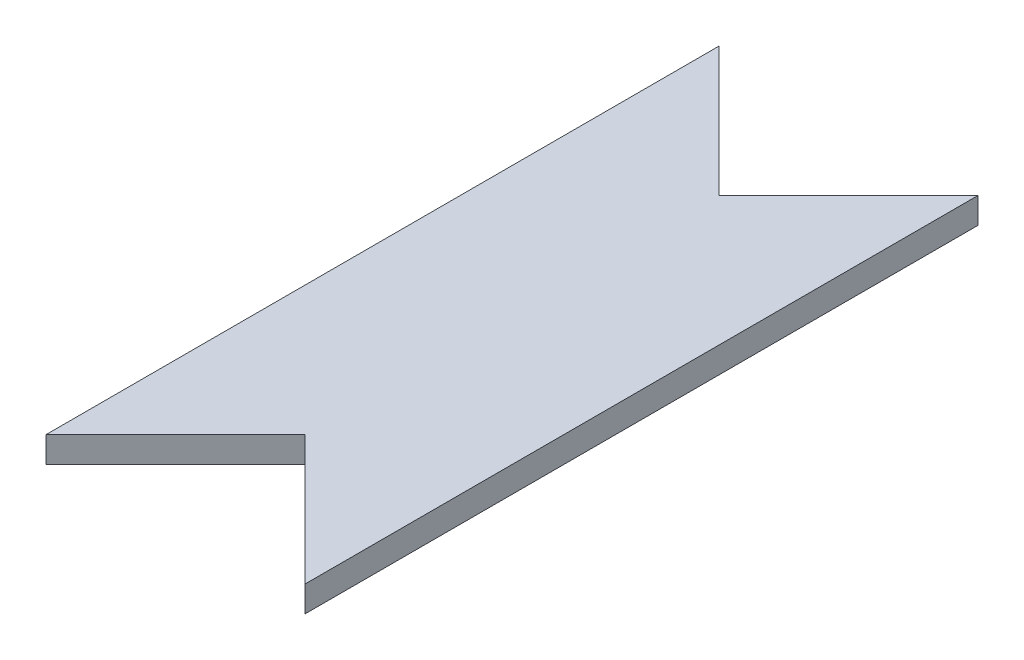
ISO-10303-21;
HEADER;
FILE_DESCRIPTION(('STEP AP214'),'2;1');
FILE_NAME('part.step','',(''),(''),'','','');
FILE_SCHEMA(('AUTOMOTIVE_DESIGN { 1 0 10303 214 1 1 1 1 }'));
ENDSEC;
DATA;
#1=APPLICATION_CONTEXT('core data for automotive mechanical design processes');
#2=APPLICATION_PROTOCOL_DEFINITION('international standard','automotive_design',2000,#1);
#3=PRODUCT_CONTEXT('',#1,'mechanical');
#4=PRODUCT('Part','Part','',(#3));
#5=PRODUCT_RELATED_PRODUCT_CATEGORY('part','',(#4));
#6=PRODUCT_DEFINITION_FORMATION('','',#4);
#7=PRODUCT_DEFINITION_CONTEXT('part definition',#1,'design');
#8=PRODUCT_DEFINITION('design','',#6,#7);
#9=PRODUCT_DEFINITION_SHAPE('','',#8);
#10=(LENGTH_UNIT() NAMED_UNIT(*) SI_UNIT(.MILLI.,.METRE.));
#11=(NAMED_UNIT(*) PLANE_ANGLE_UNIT() SI_UNIT($,.RADIAN.));
#12=(NAMED_UNIT(*) SI_UNIT($,.STERADIAN.) SOLID_ANGLE_UNIT());
#13=UNCERTAINTY_MEASURE_WITH_UNIT(LENGTH_MEASURE(1.E-05),#10,'distance_accuracy_value','');
#14=(GEOMETRIC_REPRESENTATION_CONTEXT(3) GLOBAL_UNCERTAINTY_ASSIGNED_CONTEXT((#13)) GLOBAL_UNIT_ASSIGNED_CONTEXT((#10,
#11,#12)) REPRESENTATION_CONTEXT('',''));
#15=CARTESIAN_POINT('',(0.,0.,0.));
#16=DIRECTION('',(0.,0.,1.));
#17=DIRECTION('',(1.,0.,0.));
#18=AXIS2_PLACEMENT_3D('',#15,#16,#17);
#19=CARTESIAN_POINT('',(3.8141971391716,1.27,10.7991971391716));
#20=DIRECTION('',(0.707106781186551,0.,-0.707106781186544));
#21=DIRECTION('',(-0.707106781186544,0.,-0.707106781186551));
#22=AXIS2_PLACEMENT_3D('',#19,#20,#21);
#23=PLANE('',#22);
#24=DIRECTION('',(0.707106781186544,0.,0.707106781186551));
#25=VECTOR('',#24,1.);
#26=CARTESIAN_POINT('',(3.8141971391716,0.,10.7991971391716));
#27=LINE('',#26,#25);
#28=CARTESIAN_POINT('',(3.8141971391716,0.,10.7991971391716));
#29=VERTEX_POINT('',#28);
#30=CARTESIAN_POINT('',(10.1641971391716,0.,17.1491971391717));
#31=VERTEX_POINT('',#30);
#32=EDGE_CURVE('E121',#29,#31,#27,.T.);
#33=ORIENTED_EDGE('',*,*,#32,.T.);
#34=DIRECTION('',(0.,-1.,0.));
#35=VECTOR('',#34,1.);
#36=CARTESIAN_POINT('',(10.1641971391716,1.27,17.1491971391717));
#37=LINE('',#36,#35);
#38=CARTESIAN_POINT('',(10.1641971391716,1.27,17.1491971391717));
#39=VERTEX_POINT('',#38);
#40=EDGE_CURVE('E11',#39,#31,#37,.T.);
#41=ORIENTED_EDGE('',*,*,#40,.F.);
#42=DIRECTION('',(0.707106781186544,0.,0.707106781186551));
#43=VECTOR('',#42,1.);
#44=CARTESIAN_POINT('',(3.8141971391716,1.27,10.7991971391716));
#45=LINE('',#44,#43);
#46=CARTESIAN_POINT('',(3.8141971391716,1.27,10.7991971391716));
#47=VERTEX_POINT('',#46);
#48=EDGE_CURVE('E131',#47,#39,#45,.T.);
#49=ORIENTED_EDGE('',*,*,#48,.F.);
#50=DIRECTION('',(0.,-1.,0.));
#51=VECTOR('',#50,1.);
#52=CARTESIAN_POINT('',(3.8141971391716,1.27,10.7991971391716));
#53=LINE('',#52,#51);
#54=EDGE_CURVE('E117',#47,#29,#53,.T.);
#55=ORIENTED_EDGE('',*,*,#54,.T.);
#56=EDGE_LOOP('',(#33,#41,#49,#55));
#57=FACE_BOUND('',#56,.T.);
#58=ADVANCED_FACE('F37',(#57),#23,.F.);
#59=CARTESIAN_POINT('',(10.1641971391716,1.27,17.1491971391717));
#60=DIRECTION('',(-1.,0.,0.));
#61=DIRECTION('',(0.,0.,1.));
#62=AXIS2_PLACEMENT_3D('',#59,#60,#61);
#63=PLANE('',#62);
#64=DIRECTION('',(0.,0.,-1.));
#65=VECTOR('',#64,1.);
#66=CARTESIAN_POINT('',(10.1641971391716,0.,17.1491971391717));
#67=LINE('',#66,#65);
#68=CARTESIAN_POINT('',(10.1641971391716,0.,-15.8708028608285));
#69=VERTEX_POINT('',#68);
#70=EDGE_CURVE('E124',#31,#69,#67,.T.);
#71=ORIENTED_EDGE('',*,*,#70,.T.);
#72=DIRECTION('',(0.,-1.,0.));
#73=VECTOR('',#72,1.);
#74=CARTESIAN_POINT('',(10.1641971391716,1.27,-15.8708028608285));
#75=LINE('',#74,#73);
#76=CARTESIAN_POINT('',(10.1641971391716,1.27,-15.8708028608285));
#77=VERTEX_POINT('',#76);
#78=EDGE_CURVE('E45',#77,#69,#75,.T.);
#79=ORIENTED_EDGE('',*,*,#78,.F.);
#80=DIRECTION('',(0.,0.,-1.));
#81=VECTOR('',#80,1.);
#82=CARTESIAN_POINT('',(10.1641971391716,1.27,17.1491971391717));
#83=LINE('',#82,#81);
#84=EDGE_CURVE('E90',#39,#77,#83,.T.);
#85=ORIENTED_EDGE('',*,*,#84,.F.);
#86=ORIENTED_EDGE('',*,*,#40,.T.);
#87=EDGE_LOOP('',(#71,#79,#85,#86));
#88=FACE_BOUND('',#87,.T.);
#89=ADVANCED_FACE('F155',(#88),#63,.F.);
#90=CARTESIAN_POINT('',(10.1641971391716,1.27,-15.8708028608285));
#91=DIRECTION('',(0.707106781186551,0.,0.707106781186544));
#92=DIRECTION('',(0.707106781186544,0.,-0.707106781186551));
#93=AXIS2_PLACEMENT_3D('',#90,#91,#92);
#94=PLANE('',#93);
#95=DIRECTION('',(-0.707106781186544,0.,0.707106781186551));
#96=VECTOR('',#95,1.);
#97=CARTESIAN_POINT('',(10.1641971391716,0.,-15.8708028608285));
#98=LINE('',#97,#96);
#99=CARTESIAN_POINT('',(3.8141971391716,0.,-9.52080286082842));
#100=VERTEX_POINT('',#99);
#101=EDGE_CURVE('E126',#69,#100,#98,.T.);
#102=ORIENTED_EDGE('',*,*,#101,.T.);
#103=DIRECTION('',(0.,-1.,0.));
#104=VECTOR('',#103,1.);
#105=CARTESIAN_POINT('',(3.8141971391716,1.27,-9.52080286082842));
#106=LINE('',#105,#104);
#107=CARTESIAN_POINT('',(3.8141971391716,1.27,-9.52080286082842));
#108=VERTEX_POINT('',#107);
#109=EDGE_CURVE('E112',#108,#100,#106,.T.);
#110=ORIENTED_EDGE('',*,*,#109,.F.);
#111=DIRECTION('',(-0.707106781186544,0.,0.707106781186551));
#112=VECTOR('',#111,1.);
#113=CARTESIAN_POINT('',(10.1641971391716,1.27,-15.8708028608285));
#114=LINE('',#113,#112);
#115=EDGE_CURVE('E103',#77,#108,#114,.T.);
#116=ORIENTED_EDGE('',*,*,#115,.F.);
#117=ORIENTED_EDGE('',*,*,#78,.T.);
#118=EDGE_LOOP('',(#102,#110,#116,#117));
#119=FACE_BOUND('',#118,.T.);
#120=ADVANCED_FACE('F137',(#119),#94,.F.);
#121=CARTESIAN_POINT('',(-2.5358028608284,1.27,-15.8708028608285));
#122=DIRECTION('',(-0.707106781186551,0.,0.707106781186544));
#123=DIRECTION('',(0.707106781186544,0.,0.707106781186551));
#124=AXIS2_PLACEMENT_3D('',#121,#122,#123);
#125=PLANE('',#124);
#126=DIRECTION('',(-0.707106781186544,0.,-0.707106781186551));
#127=VECTOR('',#126,1.);
#128=CARTESIAN_POINT('',(-2.5358028608284,0.,-15.8708028608285));
#129=LINE('',#128,#127);
#130=CARTESIAN_POINT('',(-2.5358028608284,0.,-15.8708028608285));
#131=VERTEX_POINT('',#130);
#132=EDGE_CURVE('E111',#100,#131,#129,.T.);
#133=ORIENTED_EDGE('',*,*,#132,.T.);
#134=DIRECTION('',(0.,-1.,0.));
#135=VECTOR('',#134,1.);
#136=CARTESIAN_POINT('',(-2.5358028608284,1.27,-15.8708028608285));
#137=LINE('',#136,#135);
#138=CARTESIAN_POINT('',(-2.5358028608284,1.27,-15.8708028608285));
#139=VERTEX_POINT('',#138);
#140=EDGE_CURVE('E108',#139,#131,#137,.T.);
#141=ORIENTED_EDGE('',*,*,#140,.F.);
#142=DIRECTION('',(-0.707106781186544,0.,-0.707106781186551));
#143=VECTOR('',#142,1.);
#144=CARTESIAN_POINT('',(-2.5358028608284,1.27,-15.8708028608285));
#145=LINE('',#144,#143);
#146=EDGE_CURVE('E97',#108,#139,#145,.T.);
#147=ORIENTED_EDGE('',*,*,#146,.F.);
#148=ORIENTED_EDGE('',*,*,#109,.T.);
#149=EDGE_LOOP('',(#133,#141,#147,#148));
#150=FACE_BOUND('',#149,.T.);
#151=ADVANCED_FACE('F109',(#150),#125,.F.);
#152=CARTESIAN_POINT('',(-2.5358028608284,1.27,17.1491971391717));
#153=DIRECTION('',(1.,0.,0.));
#154=DIRECTION('',(0.,0.,-1.));
#155=AXIS2_PLACEMENT_3D('',#152,#153,#154);
#156=PLANE('',#155);
#157=DIRECTION('',(0.,0.,1.));
#158=VECTOR('',#157,1.);
#159=CARTESIAN_POINT('',(-2.5358028608284,0.,17.1491971391717));
#160=LINE('',#159,#158);
#161=CARTESIAN_POINT('',(-2.5358028608284,0.,17.1491971391717));
#162=VERTEX_POINT('',#161);
#163=EDGE_CURVE('E76',#131,#162,#160,.T.);
#164=ORIENTED_EDGE('',*,*,#163,.T.);
#165=DIRECTION('',(0.,-1.,0.));
#166=VECTOR('',#165,1.);
#167=CARTESIAN_POINT('',(-2.5358028608284,1.27,17.1491971391717));
#168=LINE('',#167,#166);
#169=CARTESIAN_POINT('',(-2.5358028608284,1.27,17.1491971391717));
#170=VERTEX_POINT('',#169);
#171=EDGE_CURVE('E113',#170,#162,#168,.T.);
#172=ORIENTED_EDGE('',*,*,#171,.F.);
#173=DIRECTION('',(0.,0.,1.));
#174=VECTOR('',#173,1.);
#175=CARTESIAN_POINT('',(-2.5358028608284,1.27,17.1491971391717));
#176=LINE('',#175,#174);
#177=EDGE_CURVE('E101',#139,#170,#176,.T.);
#178=ORIENTED_EDGE('',*,*,#177,.F.);
#179=ORIENTED_EDGE('',*,*,#140,.T.);
#180=EDGE_LOOP('',(#164,#172,#178,#179));
#181=FACE_BOUND('',#180,.T.);
#182=ADVANCED_FACE('F115',(#181),#156,.F.);
#183=CARTESIAN_POINT('',(3.8141971391716,1.27,10.7991971391716));
#184=DIRECTION('',(-0.707106781186551,0.,-0.707106781186544));
#185=DIRECTION('',(-0.707106781186544,0.,0.707106781186551));
#186=AXIS2_PLACEMENT_3D('',#183,#184,#185);
#187=PLANE('',#186);
#188=DIRECTION('',(0.707106781186544,0.,-0.707106781186551));
#189=VECTOR('',#188,1.);
#190=CARTESIAN_POINT('',(3.8141971391716,0.,10.7991971391716));
#191=LINE('',#190,#189);
#192=EDGE_CURVE('E82',#162,#29,#191,.T.);
#193=ORIENTED_EDGE('',*,*,#192,.T.);
#194=ORIENTED_EDGE('',*,*,#54,.F.);
#195=DIRECTION('',(0.707106781186544,0.,-0.707106781186551));
#196=VECTOR('',#195,1.);
#197=CARTESIAN_POINT('',(3.8141971391716,1.27,10.7991971391716));
#198=LINE('',#197,#196);
#199=EDGE_CURVE('E53',#170,#47,#198,.T.);
#200=ORIENTED_EDGE('',*,*,#199,.F.);
#201=ORIENTED_EDGE('',*,*,#171,.T.);
#202=EDGE_LOOP('',(#193,#194,#200,#201));
#203=FACE_BOUND('',#202,.T.);
#204=ADVANCED_FACE('F144',(#203),#187,.F.);
#205=CARTESIAN_POINT('',(0.,1.27,0.));
#206=DIRECTION('',(0.,-1.,0.));
#207=DIRECTION('',(0.,0.,-1.));
#208=AXIS2_PLACEMENT_3D('',#205,#206,#207);
#209=PLANE('',#208);
#210=ORIENTED_EDGE('',*,*,#48,.T.);
#211=ORIENTED_EDGE('',*,*,#84,.T.);
#212=ORIENTED_EDGE('',*,*,#115,.T.);
#213=ORIENTED_EDGE('',*,*,#146,.T.);
#214=ORIENTED_EDGE('',*,*,#177,.T.);
#215=ORIENTED_EDGE('',*,*,#199,.T.);
#216=EDGE_LOOP('',(#210,#211,#212,#213,#214,#215));
#217=FACE_BOUND('',#216,.T.);
#218=ADVANCED_FACE('F99',(#217),#209,.F.);
#219=CARTESIAN_POINT('',(0.,0.,0.));
#220=DIRECTION('',(0.,-1.,0.));
#221=DIRECTION('',(0.,0.,-1.));
#222=AXIS2_PLACEMENT_3D('',#219,#220,#221);
#223=PLANE('',#222);
#224=ORIENTED_EDGE('',*,*,#32,.F.);
#225=ORIENTED_EDGE('',*,*,#192,.F.);
#226=ORIENTED_EDGE('',*,*,#163,.F.);
#227=ORIENTED_EDGE('',*,*,#132,.F.);
#228=ORIENTED_EDGE('',*,*,#101,.F.);
#229=ORIENTED_EDGE('',*,*,#70,.F.);
#230=EDGE_LOOP('',(#224,#225,#226,#227,#228,#229));
#231=FACE_BOUND('',#230,.T.);
#232=ADVANCED_FACE('F140',(#231),#223,.T.);
#233=CLOSED_SHELL('',(#58,#89,#120,#151,#182,#204,#218,#232));
#234=MANIFOLD_SOLID_BREP('B2',#233);
#235=ADVANCED_BREP_SHAPE_REPRESENTATION('',(#18,#234),#14);
#236=SHAPE_DEFINITION_REPRESENTATION(#9,#235);
ENDSEC;
END-ISO-10303-21;
